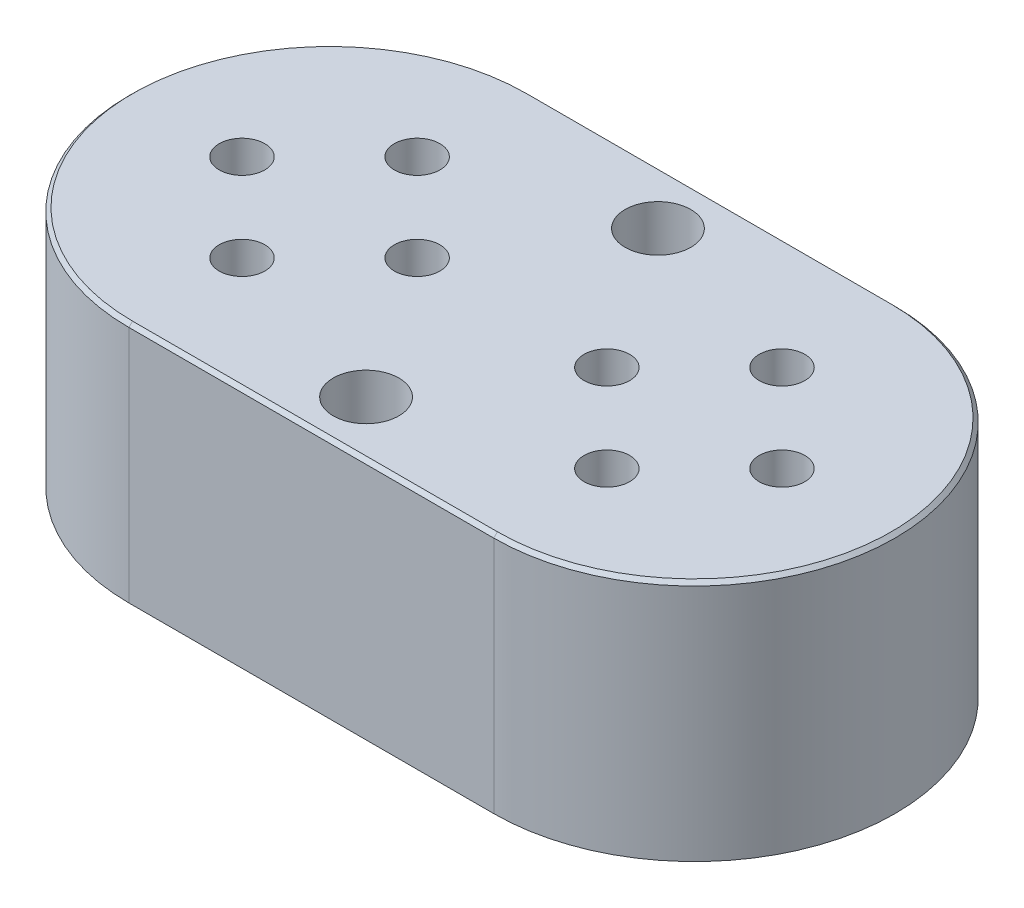
ISO-10303-21;
HEADER;
FILE_DESCRIPTION(('STEP AP214'),'2;1');
FILE_NAME('part.step','',(''),(''),'','','');
FILE_SCHEMA(('AUTOMOTIVE_DESIGN { 1 0 10303 214 1 1 1 1 }'));
ENDSEC;
DATA;
#1=APPLICATION_CONTEXT('core data for automotive mechanical design processes');
#2=APPLICATION_PROTOCOL_DEFINITION('international standard','automotive_design',2000,#1);
#3=PRODUCT_CONTEXT('',#1,'mechanical');
#4=PRODUCT('Part','Part','',(#3));
#5=PRODUCT_RELATED_PRODUCT_CATEGORY('part','',(#4));
#6=PRODUCT_DEFINITION_FORMATION('','',#4);
#7=PRODUCT_DEFINITION_CONTEXT('part definition',#1,'design');
#8=PRODUCT_DEFINITION('design','',#6,#7);
#9=PRODUCT_DEFINITION_SHAPE('','',#8);
#10=(LENGTH_UNIT() NAMED_UNIT(*) SI_UNIT(.MILLI.,.METRE.));
#11=(NAMED_UNIT(*) PLANE_ANGLE_UNIT() SI_UNIT($,.RADIAN.));
#12=(NAMED_UNIT(*) SI_UNIT($,.STERADIAN.) SOLID_ANGLE_UNIT());
#13=UNCERTAINTY_MEASURE_WITH_UNIT(LENGTH_MEASURE(1.E-05),#10,'distance_accuracy_value','');
#14=(GEOMETRIC_REPRESENTATION_CONTEXT(3) GLOBAL_UNCERTAINTY_ASSIGNED_CONTEXT((#13)) GLOBAL_UNIT_ASSIGNED_CONTEXT((#10,
#11,#12)) REPRESENTATION_CONTEXT('',''));
#15=CARTESIAN_POINT('',(0.,0.,0.));
#16=DIRECTION('',(0.,0.,1.));
#17=DIRECTION('',(1.,0.,0.));
#18=AXIS2_PLACEMENT_3D('',#15,#16,#17);
#19=CARTESIAN_POINT('',(0.,16.8656,0.));
#20=DIRECTION('',(0.,-1.,0.));
#21=DIRECTION('',(0.,0.,-1.));
#22=AXIS2_PLACEMENT_3D('',#19,#20,#21);
#23=CYLINDRICAL_SURFACE('',#22,13.97);
#24=DIRECTION('',(0.,-1.,0.));
#25=VECTOR('',#24,1.);
#26=CARTESIAN_POINT('',(0.,16.8656,13.97));
#27=LINE('',#26,#25);
#28=CARTESIAN_POINT('',(0.,16.6116,13.97));
#29=VERTEX_POINT('',#28);
#30=CARTESIAN_POINT('',(0.,0.,13.97));
#31=VERTEX_POINT('',#30);
#32=EDGE_CURVE('E86',#29,#31,#27,.T.);
#33=ORIENTED_EDGE('',*,*,#32,.F.);
#34=CARTESIAN_POINT('',(0.,16.6116,0.));
#35=DIRECTION('',(0.,1.,0.));
#36=DIRECTION('',(0.,0.,1.));
#37=AXIS2_PLACEMENT_3D('',#34,#35,#36);
#38=CIRCLE('',#37,13.97);
#39=CARTESIAN_POINT('',(0.,16.6116,-13.97));
#40=VERTEX_POINT('',#39);
#41=EDGE_CURVE('E11',#29,#40,#38,.F.);
#42=ORIENTED_EDGE('',*,*,#41,.T.);
#43=DIRECTION('',(0.,-1.,0.));
#44=VECTOR('',#43,1.);
#45=CARTESIAN_POINT('',(0.,16.8656,-13.97));
#46=LINE('',#45,#44);
#47=CARTESIAN_POINT('',(0.,0.,-13.97));
#48=VERTEX_POINT('',#47);
#49=EDGE_CURVE('E103',#40,#48,#46,.T.);
#50=ORIENTED_EDGE('',*,*,#49,.T.);
#51=CARTESIAN_POINT('',(0.,0.,0.));
#52=DIRECTION('',(0.,1.,0.));
#53=DIRECTION('',(0.,0.,1.));
#54=AXIS2_PLACEMENT_3D('',#51,#52,#53);
#55=CIRCLE('',#54,13.97);
#56=EDGE_CURVE('E99',#48,#31,#55,.T.);
#57=ORIENTED_EDGE('',*,*,#56,.T.);
#58=EDGE_LOOP('',(#33,#42,#50,#57));
#59=FACE_BOUND('',#58,.T.);
#60=ADVANCED_FACE('F34',(#59),#23,.T.);
#61=CARTESIAN_POINT('',(0.,16.8656,13.97));
#62=DIRECTION('',(0.,0.,-1.));
#63=DIRECTION('',(-1.,0.,0.));
#64=AXIS2_PLACEMENT_3D('',#61,#62,#63);
#65=PLANE('',#64);
#66=DIRECTION('',(0.,-1.,0.));
#67=VECTOR('',#66,1.);
#68=CARTESIAN_POINT('',(25.4,16.8656,13.97));
#69=LINE('',#68,#67);
#70=CARTESIAN_POINT('',(25.4,16.6116,13.97));
#71=VERTEX_POINT('',#70);
#72=CARTESIAN_POINT('',(25.4,0.,13.97));
#73=VERTEX_POINT('',#72);
#74=EDGE_CURVE('E93',#71,#73,#69,.T.);
#75=ORIENTED_EDGE('',*,*,#74,.F.);
#76=DIRECTION('',(-1.,0.,0.));
#77=VECTOR('',#76,1.);
#78=CARTESIAN_POINT('',(0.,16.6116,13.97));
#79=LINE('',#78,#77);
#80=EDGE_CURVE('E44',#71,#29,#79,.T.);
#81=ORIENTED_EDGE('',*,*,#80,.T.);
#82=ORIENTED_EDGE('',*,*,#32,.T.);
#83=DIRECTION('',(1.,0.,0.));
#84=VECTOR('',#83,1.);
#85=CARTESIAN_POINT('',(0.,0.,13.97));
#86=LINE('',#85,#84);
#87=EDGE_CURVE('E89',#31,#73,#86,.T.);
#88=ORIENTED_EDGE('',*,*,#87,.T.);
#89=EDGE_LOOP('',(#75,#81,#82,#88));
#90=FACE_BOUND('',#89,.T.);
#91=ADVANCED_FACE('F88',(#90),#65,.F.);
#92=CARTESIAN_POINT('',(25.4,16.8656,0.));
#93=DIRECTION('',(0.,-1.,0.));
#94=DIRECTION('',(0.,0.,-1.));
#95=AXIS2_PLACEMENT_3D('',#92,#93,#94);
#96=CYLINDRICAL_SURFACE('',#95,13.97);
#97=DIRECTION('',(0.,-1.,0.));
#98=VECTOR('',#97,1.);
#99=CARTESIAN_POINT('',(25.4,16.8656,-13.97));
#100=LINE('',#99,#98);
#101=CARTESIAN_POINT('',(25.4,16.6116,-13.97));
#102=VERTEX_POINT('',#101);
#103=CARTESIAN_POINT('',(25.4,0.,-13.97));
#104=VERTEX_POINT('',#103);
#105=EDGE_CURVE('E116',#102,#104,#100,.T.);
#106=ORIENTED_EDGE('',*,*,#105,.F.);
#107=CARTESIAN_POINT('',(25.4,16.6116,0.));
#108=DIRECTION('',(0.,1.,0.));
#109=DIRECTION('',(0.,0.,1.));
#110=AXIS2_PLACEMENT_3D('',#107,#108,#109);
#111=CIRCLE('',#110,13.97);
#112=EDGE_CURVE('E127',#102,#71,#111,.F.);
#113=ORIENTED_EDGE('',*,*,#112,.T.);
#114=ORIENTED_EDGE('',*,*,#74,.T.);
#115=CARTESIAN_POINT('',(25.4,0.,0.));
#116=DIRECTION('',(0.,1.,0.));
#117=DIRECTION('',(0.,0.,1.));
#118=AXIS2_PLACEMENT_3D('',#115,#116,#117);
#119=CIRCLE('',#118,13.97);
#120=EDGE_CURVE('E101',#73,#104,#119,.T.);
#121=ORIENTED_EDGE('',*,*,#120,.T.);
#122=EDGE_LOOP('',(#106,#113,#114,#121));
#123=FACE_BOUND('',#122,.T.);
#124=ADVANCED_FACE('F157',(#123),#96,.T.);
#125=CARTESIAN_POINT('',(0.,16.8656,-13.97));
#126=DIRECTION('',(0.,0.,1.));
#127=DIRECTION('',(1.,0.,0.));
#128=AXIS2_PLACEMENT_3D('',#125,#126,#127);
#129=PLANE('',#128);
#130=ORIENTED_EDGE('',*,*,#49,.F.);
#131=DIRECTION('',(1.,0.,0.));
#132=VECTOR('',#131,1.);
#133=CARTESIAN_POINT('',(25.4,16.6116,-13.97));
#134=LINE('',#133,#132);
#135=EDGE_CURVE('E130',#40,#102,#134,.T.);
#136=ORIENTED_EDGE('',*,*,#135,.T.);
#137=ORIENTED_EDGE('',*,*,#105,.T.);
#138=DIRECTION('',(-1.,0.,0.));
#139=VECTOR('',#138,1.);
#140=CARTESIAN_POINT('',(0.,0.,-13.97));
#141=LINE('',#140,#139);
#142=EDGE_CURVE('E113',#104,#48,#141,.T.);
#143=ORIENTED_EDGE('',*,*,#142,.T.);
#144=EDGE_LOOP('',(#130,#136,#137,#143));
#145=FACE_BOUND('',#144,.T.);
#146=ADVANCED_FACE('F159',(#145),#129,.F.);
#147=CARTESIAN_POINT('',(0.,16.8656,0.));
#148=DIRECTION('',(0.,1.,0.));
#149=DIRECTION('',(0.,0.,1.));
#150=AXIS2_PLACEMENT_3D('',#147,#148,#149);
#151=PLANE('',#150);
#152=CARTESIAN_POINT('',(12.7,16.8656,-10.16));
#153=DIRECTION('',(0.,1.,0.));
#154=DIRECTION('',(0.,0.,1.));
#155=AXIS2_PLACEMENT_3D('',#152,#153,#154);
#156=CIRCLE('',#155,2.286);
#157=CARTESIAN_POINT('',(12.7,16.8656,-7.874));
#158=VERTEX_POINT('',#157);
#159=EDGE_CURVE('E282',#158,#158,#156,.T.);
#160=ORIENTED_EDGE('',*,*,#159,.F.);
#161=EDGE_LOOP('',(#160));
#162=FACE_BOUND('',#161,.T.);
#163=CARTESIAN_POINT('',(12.7,16.8656,10.16));
#164=DIRECTION('',(0.,1.,0.));
#165=DIRECTION('',(0.,0.,-1.));
#166=AXIS2_PLACEMENT_3D('',#163,#164,#165);
#167=CIRCLE('',#166,2.286);
#168=CARTESIAN_POINT('',(12.7,16.8656,7.874));
#169=VERTEX_POINT('',#168);
#170=EDGE_CURVE('E288',#169,#169,#167,.T.);
#171=ORIENTED_EDGE('',*,*,#170,.F.);
#172=EDGE_LOOP('',(#171));
#173=FACE_BOUND('',#172,.T.);
#174=CARTESIAN_POINT('',(31.496,16.8656,0.));
#175=DIRECTION('',(0.,1.,0.));
#176=DIRECTION('',(0.,0.,1.));
#177=AXIS2_PLACEMENT_3D('',#174,#175,#176);
#178=CIRCLE('',#177,1.5875);
#179=CARTESIAN_POINT('',(31.496,16.8656,1.5875));
#180=VERTEX_POINT('',#179);
#181=EDGE_CURVE('E314',#180,#180,#178,.T.);
#182=ORIENTED_EDGE('',*,*,#181,.F.);
#183=EDGE_LOOP('',(#182));
#184=FACE_BOUND('',#183,.T.);
#185=CARTESIAN_POINT('',(25.4,16.8656,6.096));
#186=DIRECTION('',(0.,1.,0.));
#187=DIRECTION('',(0.,0.,1.));
#188=AXIS2_PLACEMENT_3D('',#185,#186,#187);
#189=CIRCLE('',#188,1.5875);
#190=CARTESIAN_POINT('',(25.4,16.8656,7.6835));
#191=VERTEX_POINT('',#190);
#192=EDGE_CURVE('E320',#191,#191,#189,.T.);
#193=ORIENTED_EDGE('',*,*,#192,.F.);
#194=EDGE_LOOP('',(#193));
#195=FACE_BOUND('',#194,.T.);
#196=CARTESIAN_POINT('',(19.304,16.8656,0.));
#197=DIRECTION('',(0.,1.,0.));
#198=DIRECTION('',(0.,0.,1.));
#199=AXIS2_PLACEMENT_3D('',#196,#197,#198);
#200=CIRCLE('',#199,1.5875);
#201=CARTESIAN_POINT('',(19.304,16.8656,1.5875));
#202=VERTEX_POINT('',#201);
#203=EDGE_CURVE('E326',#202,#202,#200,.T.);
#204=ORIENTED_EDGE('',*,*,#203,.F.);
#205=EDGE_LOOP('',(#204));
#206=FACE_BOUND('',#205,.T.);
#207=CARTESIAN_POINT('',(-6.096,16.8656,0.));
#208=DIRECTION('',(0.,1.,0.));
#209=DIRECTION('',(0.,0.,-1.));
#210=AXIS2_PLACEMENT_3D('',#207,#208,#209);
#211=CIRCLE('',#210,1.5875);
#212=CARTESIAN_POINT('',(-6.096,16.8656,-1.5875));
#213=VERTEX_POINT('',#212);
#214=EDGE_CURVE('E296',#213,#213,#211,.T.);
#215=ORIENTED_EDGE('',*,*,#214,.F.);
#216=EDGE_LOOP('',(#215));
#217=FACE_BOUND('',#216,.T.);
#218=CARTESIAN_POINT('',(6.096,16.8656,0.));
#219=DIRECTION('',(0.,1.,0.));
#220=DIRECTION('',(0.,0.,-1.));
#221=AXIS2_PLACEMENT_3D('',#218,#219,#220);
#222=CIRCLE('',#221,1.5875);
#223=CARTESIAN_POINT('',(6.096,16.8656,-1.5875));
#224=VERTEX_POINT('',#223);
#225=EDGE_CURVE('E297',#224,#224,#222,.T.);
#226=ORIENTED_EDGE('',*,*,#225,.F.);
#227=EDGE_LOOP('',(#226));
#228=FACE_BOUND('',#227,.T.);
#229=CARTESIAN_POINT('',(0.,16.8656,6.096));
#230=DIRECTION('',(0.,1.,0.));
#231=DIRECTION('',(0.,0.,-1.));
#232=AXIS2_PLACEMENT_3D('',#229,#230,#231);
#233=CIRCLE('',#232,1.5875);
#234=CARTESIAN_POINT('',(0.,16.8656,4.5085));
#235=VERTEX_POINT('',#234);
#236=EDGE_CURVE('E303',#235,#235,#233,.T.);
#237=ORIENTED_EDGE('',*,*,#236,.F.);
#238=EDGE_LOOP('',(#237));
#239=FACE_BOUND('',#238,.T.);
#240=CARTESIAN_POINT('',(0.,16.8656,-6.096));
#241=DIRECTION('',(0.,1.,0.));
#242=DIRECTION('',(0.,0.,-1.));
#243=AXIS2_PLACEMENT_3D('',#240,#241,#242);
#244=CIRCLE('',#243,1.5875);
#245=CARTESIAN_POINT('',(0.,16.8656,-7.6835));
#246=VERTEX_POINT('',#245);
#247=EDGE_CURVE('E285',#246,#246,#244,.T.);
#248=ORIENTED_EDGE('',*,*,#247,.F.);
#249=EDGE_LOOP('',(#248));
#250=FACE_BOUND('',#249,.T.);
#251=CARTESIAN_POINT('',(25.4,16.8656,-6.096));
#252=DIRECTION('',(0.,1.,0.));
#253=DIRECTION('',(0.,0.,1.));
#254=AXIS2_PLACEMENT_3D('',#251,#252,#253);
#255=CIRCLE('',#254,1.5875);
#256=CARTESIAN_POINT('',(25.4,16.8656,-4.5085));
#257=VERTEX_POINT('',#256);
#258=EDGE_CURVE('E109',#257,#257,#255,.T.);
#259=ORIENTED_EDGE('',*,*,#258,.F.);
#260=EDGE_LOOP('',(#259));
#261=FACE_BOUND('',#260,.T.);
#262=DIRECTION('',(1.,0.,0.));
#263=VECTOR('',#262,1.);
#264=CARTESIAN_POINT('',(25.4,16.8656,13.716));
#265=LINE('',#264,#263);
#266=CARTESIAN_POINT('',(0.,16.8656,13.716));
#267=VERTEX_POINT('',#266);
#268=CARTESIAN_POINT('',(25.4,16.8656,13.716));
#269=VERTEX_POINT('',#268);
#270=EDGE_CURVE('E120',#267,#269,#265,.T.);
#271=ORIENTED_EDGE('',*,*,#270,.T.);
#272=CARTESIAN_POINT('',(25.4,16.8656,0.));
#273=DIRECTION('',(0.,1.,0.));
#274=DIRECTION('',(0.,0.,1.));
#275=AXIS2_PLACEMENT_3D('',#272,#273,#274);
#276=CIRCLE('',#275,13.716);
#277=CARTESIAN_POINT('',(25.4,16.8656,-13.716));
#278=VERTEX_POINT('',#277);
#279=EDGE_CURVE('E124',#269,#278,#276,.T.);
#280=ORIENTED_EDGE('',*,*,#279,.T.);
#281=DIRECTION('',(-1.,0.,0.));
#282=VECTOR('',#281,1.);
#283=CARTESIAN_POINT('',(0.,16.8656,-13.716));
#284=LINE('',#283,#282);
#285=CARTESIAN_POINT('',(0.,16.8656,-13.716));
#286=VERTEX_POINT('',#285);
#287=EDGE_CURVE('E122',#278,#286,#284,.T.);
#288=ORIENTED_EDGE('',*,*,#287,.T.);
#289=CARTESIAN_POINT('',(0.,16.8656,0.));
#290=DIRECTION('',(0.,1.,0.));
#291=DIRECTION('',(0.,0.,1.));
#292=AXIS2_PLACEMENT_3D('',#289,#290,#291);
#293=CIRCLE('',#292,13.716);
#294=EDGE_CURVE('E92',#286,#267,#293,.T.);
#295=ORIENTED_EDGE('',*,*,#294,.T.);
#296=EDGE_LOOP('',(#271,#280,#288,#295));
#297=FACE_BOUND('',#296,.T.);
#298=ADVANCED_FACE('F149',(#162,#173,#184,#195,#206,#217,#228,#239,#250,#261,#297),#151,.T.);
#299=CARTESIAN_POINT('',(0.,0.,0.));
#300=DIRECTION('',(0.,1.,0.));
#301=DIRECTION('',(0.,0.,1.));
#302=AXIS2_PLACEMENT_3D('',#299,#300,#301);
#303=PLANE('',#302);
#304=CARTESIAN_POINT('',(12.7,0.,-10.16));
#305=DIRECTION('',(0.,1.,0.));
#306=DIRECTION('',(0.,0.,1.));
#307=AXIS2_PLACEMENT_3D('',#304,#305,#306);
#308=CIRCLE('',#307,2.286);
#309=CARTESIAN_POINT('',(12.7,0.,-7.874));
#310=VERTEX_POINT('',#309);
#311=EDGE_CURVE('E279',#310,#310,#308,.T.);
#312=ORIENTED_EDGE('',*,*,#311,.T.);
#313=EDGE_LOOP('',(#312));
#314=FACE_BOUND('',#313,.T.);
#315=CARTESIAN_POINT('',(12.7,0.,10.16));
#316=DIRECTION('',(0.,1.,0.));
#317=DIRECTION('',(0.,0.,-1.));
#318=AXIS2_PLACEMENT_3D('',#315,#316,#317);
#319=CIRCLE('',#318,2.286);
#320=CARTESIAN_POINT('',(12.7,0.,7.874));
#321=VERTEX_POINT('',#320);
#322=EDGE_CURVE('E283',#321,#321,#319,.T.);
#323=ORIENTED_EDGE('',*,*,#322,.T.);
#324=EDGE_LOOP('',(#323));
#325=FACE_BOUND('',#324,.T.);
#326=ORIENTED_EDGE('',*,*,#56,.F.);
#327=ORIENTED_EDGE('',*,*,#142,.F.);
#328=ORIENTED_EDGE('',*,*,#120,.F.);
#329=ORIENTED_EDGE('',*,*,#87,.F.);
#330=EDGE_LOOP('',(#326,#327,#328,#329));
#331=FACE_BOUND('',#330,.T.);
#332=ADVANCED_FACE('F97',(#314,#325,#331),#303,.F.);
#333=CARTESIAN_POINT('',(0.,16.8656,0.));
#334=DIRECTION('',(0.,-1.,0.));
#335=DIRECTION('',(0.,0.,-1.));
#336=AXIS2_PLACEMENT_3D('',#333,#334,#335);
#337=CONICAL_SURFACE('',#336,13.716,0.785398163397442);
#338=DIRECTION('',(0.,0.707106781186552,0.707106781186543));
#339=VECTOR('',#338,1.);
#340=CARTESIAN_POINT('',(0.,16.6116,-13.97));
#341=LINE('',#340,#339);
#342=EDGE_CURVE('E107',#40,#286,#341,.T.);
#343=ORIENTED_EDGE('',*,*,#342,.F.);
#344=ORIENTED_EDGE('',*,*,#41,.F.);
#345=DIRECTION('',(0.,-0.707106781186552,0.707106781186543));
#346=VECTOR('',#345,1.);
#347=CARTESIAN_POINT('',(0.,16.8656,13.716));
#348=LINE('',#347,#346);
#349=EDGE_CURVE('E39',#267,#29,#348,.T.);
#350=ORIENTED_EDGE('',*,*,#349,.F.);
#351=ORIENTED_EDGE('',*,*,#294,.F.);
#352=EDGE_LOOP('',(#343,#344,#350,#351));
#353=FACE_BOUND('',#352,.T.);
#354=ADVANCED_FACE('F37',(#353),#337,.T.);
#355=CARTESIAN_POINT('',(0.,16.8656,13.716));
#356=DIRECTION('',(0.,0.707106781186543,0.707106781186552));
#357=DIRECTION('',(-1.,0.,0.));
#358=AXIS2_PLACEMENT_3D('',#355,#356,#357);
#359=PLANE('',#358);
#360=ORIENTED_EDGE('',*,*,#349,.T.);
#361=ORIENTED_EDGE('',*,*,#80,.F.);
#362=DIRECTION('',(0.,-0.707106781186552,0.707106781186543));
#363=VECTOR('',#362,1.);
#364=CARTESIAN_POINT('',(25.4,16.8656,13.716));
#365=LINE('',#364,#363);
#366=EDGE_CURVE('E135',#269,#71,#365,.T.);
#367=ORIENTED_EDGE('',*,*,#366,.F.);
#368=ORIENTED_EDGE('',*,*,#270,.F.);
#369=EDGE_LOOP('',(#360,#361,#367,#368));
#370=FACE_BOUND('',#369,.T.);
#371=ADVANCED_FACE('F188',(#370),#359,.T.);
#372=CARTESIAN_POINT('',(0.,16.8656,-13.716));
#373=DIRECTION('',(0.,0.707106781186543,-0.707106781186552));
#374=DIRECTION('',(1.,0.,0.));
#375=AXIS2_PLACEMENT_3D('',#372,#373,#374);
#376=PLANE('',#375);
#377=ORIENTED_EDGE('',*,*,#342,.T.);
#378=ORIENTED_EDGE('',*,*,#287,.F.);
#379=DIRECTION('',(0.,0.707106781186552,0.707106781186543));
#380=VECTOR('',#379,1.);
#381=CARTESIAN_POINT('',(25.4,16.6116,-13.97));
#382=LINE('',#381,#380);
#383=EDGE_CURVE('E133',#102,#278,#382,.T.);
#384=ORIENTED_EDGE('',*,*,#383,.F.);
#385=ORIENTED_EDGE('',*,*,#135,.F.);
#386=EDGE_LOOP('',(#377,#378,#384,#385));
#387=FACE_BOUND('',#386,.T.);
#388=ADVANCED_FACE('F142',(#387),#376,.T.);
#389=CARTESIAN_POINT('',(25.4,16.8656,0.));
#390=DIRECTION('',(0.,-1.,0.));
#391=DIRECTION('',(0.,0.,-1.));
#392=AXIS2_PLACEMENT_3D('',#389,#390,#391);
#393=CONICAL_SURFACE('',#392,13.716,0.785398163397442);
#394=ORIENTED_EDGE('',*,*,#366,.T.);
#395=ORIENTED_EDGE('',*,*,#112,.F.);
#396=ORIENTED_EDGE('',*,*,#383,.T.);
#397=ORIENTED_EDGE('',*,*,#279,.F.);
#398=EDGE_LOOP('',(#394,#395,#396,#397));
#399=FACE_BOUND('',#398,.T.);
#400=ADVANCED_FACE('F153',(#399),#393,.T.);
#401=CARTESIAN_POINT('',(25.4,0.508000000000002,-6.096));
#402=DIRECTION('',(0.,1.,0.));
#403=DIRECTION('',(0.,0.,1.));
#404=AXIS2_PLACEMENT_3D('',#401,#402,#403);
#405=CYLINDRICAL_SURFACE('',#404,1.5875);
#406=CARTESIAN_POINT('',(25.4,0.508000000000002,-6.096));
#407=DIRECTION('',(0.,1.,0.));
#408=DIRECTION('',(0.,0.,1.));
#409=AXIS2_PLACEMENT_3D('',#406,#407,#408);
#410=CIRCLE('',#409,1.5875);
#411=CARTESIAN_POINT('',(25.4,0.508000000000002,-4.5085));
#412=VERTEX_POINT('',#411);
#413=EDGE_CURVE('E136',#412,#412,#410,.T.);
#414=ORIENTED_EDGE('',*,*,#413,.F.);
#415=EDGE_LOOP('',(#414));
#416=FACE_BOUND('',#415,.T.);
#417=ORIENTED_EDGE('',*,*,#258,.T.);
#418=EDGE_LOOP('',(#417));
#419=FACE_BOUND('',#418,.T.);
#420=ADVANCED_FACE('F183',(#416,#419),#405,.F.);
#421=CARTESIAN_POINT('',(25.4,0.508000000000002,-6.096));
#422=DIRECTION('',(0.,1.,0.));
#423=DIRECTION('',(0.,0.,1.));
#424=AXIS2_PLACEMENT_3D('',#421,#422,#423);
#425=PLANE('',#424);
#426=ORIENTED_EDGE('',*,*,#413,.T.);
#427=EDGE_LOOP('',(#426));
#428=FACE_BOUND('',#427,.T.);
#429=ADVANCED_FACE('F207',(#428),#425,.T.);
#430=CARTESIAN_POINT('',(0.,0.508000000000002,-6.096));
#431=DIRECTION('',(0.,1.,0.));
#432=DIRECTION('',(0.,0.,1.));
#433=AXIS2_PLACEMENT_3D('',#430,#431,#432);
#434=CYLINDRICAL_SURFACE('',#433,1.5875);
#435=CARTESIAN_POINT('',(0.,0.508000000000002,-6.096));
#436=DIRECTION('',(0.,1.,0.));
#437=DIRECTION('',(0.,0.,-1.));
#438=AXIS2_PLACEMENT_3D('',#435,#436,#437);
#439=CIRCLE('',#438,1.5875);
#440=CARTESIAN_POINT('',(0.,0.508000000000002,-7.6835));
#441=VERTEX_POINT('',#440);
#442=EDGE_CURVE('E306',#441,#441,#439,.T.);
#443=ORIENTED_EDGE('',*,*,#442,.F.);
#444=EDGE_LOOP('',(#443));
#445=FACE_BOUND('',#444,.T.);
#446=ORIENTED_EDGE('',*,*,#247,.T.);
#447=EDGE_LOOP('',(#446));
#448=FACE_BOUND('',#447,.T.);
#449=ADVANCED_FACE('F211',(#445,#448),#434,.F.);
#450=CARTESIAN_POINT('',(0.,0.508000000000002,-6.096));
#451=DIRECTION('',(0.,-1.,0.));
#452=DIRECTION('',(0.,0.,-1.));
#453=AXIS2_PLACEMENT_3D('',#450,#451,#452);
#454=PLANE('',#453);
#455=ORIENTED_EDGE('',*,*,#442,.T.);
#456=EDGE_LOOP('',(#455));
#457=FACE_BOUND('',#456,.T.);
#458=ADVANCED_FACE('F249',(#457),#454,.F.);
#459=CARTESIAN_POINT('',(0.,0.508000000000002,6.096));
#460=DIRECTION('',(0.,1.,0.));
#461=DIRECTION('',(0.,0.,1.));
#462=AXIS2_PLACEMENT_3D('',#459,#460,#461);
#463=CYLINDRICAL_SURFACE('',#462,1.5875);
#464=CARTESIAN_POINT('',(0.,0.508000000000002,6.096));
#465=DIRECTION('',(0.,1.,0.));
#466=DIRECTION('',(0.,0.,-1.));
#467=AXIS2_PLACEMENT_3D('',#464,#465,#466);
#468=CIRCLE('',#467,1.5875);
#469=CARTESIAN_POINT('',(0.,0.508000000000002,4.5085));
#470=VERTEX_POINT('',#469);
#471=EDGE_CURVE('E300',#470,#470,#468,.T.);
#472=ORIENTED_EDGE('',*,*,#471,.F.);
#473=EDGE_LOOP('',(#472));
#474=FACE_BOUND('',#473,.T.);
#475=ORIENTED_EDGE('',*,*,#236,.T.);
#476=EDGE_LOOP('',(#475));
#477=FACE_BOUND('',#476,.T.);
#478=ADVANCED_FACE('F253',(#474,#477),#463,.F.);
#479=CARTESIAN_POINT('',(0.,0.508000000000002,6.096));
#480=DIRECTION('',(0.,-1.,0.));
#481=DIRECTION('',(0.,0.,-1.));
#482=AXIS2_PLACEMENT_3D('',#479,#480,#481);
#483=PLANE('',#482);
#484=ORIENTED_EDGE('',*,*,#471,.T.);
#485=EDGE_LOOP('',(#484));
#486=FACE_BOUND('',#485,.T.);
#487=ADVANCED_FACE('F257',(#486),#483,.F.);
#488=CARTESIAN_POINT('',(6.096,0.508000000000002,0.));
#489=DIRECTION('',(0.,1.,0.));
#490=DIRECTION('',(0.,0.,1.));
#491=AXIS2_PLACEMENT_3D('',#488,#489,#490);
#492=CYLINDRICAL_SURFACE('',#491,1.5875);
#493=CARTESIAN_POINT('',(6.096,0.508000000000002,0.));
#494=DIRECTION('',(0.,1.,0.));
#495=DIRECTION('',(0.,0.,-1.));
#496=AXIS2_PLACEMENT_3D('',#493,#494,#495);
#497=CIRCLE('',#496,1.5875);
#498=CARTESIAN_POINT('',(6.096,0.508000000000002,-1.5875));
#499=VERTEX_POINT('',#498);
#500=EDGE_CURVE('E293',#499,#499,#497,.T.);
#501=ORIENTED_EDGE('',*,*,#500,.F.);
#502=EDGE_LOOP('',(#501));
#503=FACE_BOUND('',#502,.T.);
#504=ORIENTED_EDGE('',*,*,#225,.T.);
#505=EDGE_LOOP('',(#504));
#506=FACE_BOUND('',#505,.T.);
#507=ADVANCED_FACE('F261',(#503,#506),#492,.F.);
#508=CARTESIAN_POINT('',(6.096,0.508000000000002,0.));
#509=DIRECTION('',(0.,-1.,0.));
#510=DIRECTION('',(0.,0.,-1.));
#511=AXIS2_PLACEMENT_3D('',#508,#509,#510);
#512=PLANE('',#511);
#513=ORIENTED_EDGE('',*,*,#500,.T.);
#514=EDGE_LOOP('',(#513));
#515=FACE_BOUND('',#514,.T.);
#516=ADVANCED_FACE('F217',(#515),#512,.F.);
#517=CARTESIAN_POINT('',(-6.096,0.508000000000002,0.));
#518=DIRECTION('',(0.,1.,0.));
#519=DIRECTION('',(0.,0.,1.));
#520=AXIS2_PLACEMENT_3D('',#517,#518,#519);
#521=CYLINDRICAL_SURFACE('',#520,1.5875);
#522=CARTESIAN_POINT('',(-6.096,0.508000000000002,0.));
#523=DIRECTION('',(0.,1.,0.));
#524=DIRECTION('',(0.,0.,-1.));
#525=AXIS2_PLACEMENT_3D('',#522,#523,#524);
#526=CIRCLE('',#525,1.5875);
#527=CARTESIAN_POINT('',(-6.096,0.508000000000002,-1.5875));
#528=VERTEX_POINT('',#527);
#529=EDGE_CURVE('E329',#528,#528,#526,.T.);
#530=ORIENTED_EDGE('',*,*,#529,.F.);
#531=EDGE_LOOP('',(#530));
#532=FACE_BOUND('',#531,.T.);
#533=ORIENTED_EDGE('',*,*,#214,.T.);
#534=EDGE_LOOP('',(#533));
#535=FACE_BOUND('',#534,.T.);
#536=ADVANCED_FACE('F213',(#532,#535),#521,.F.);
#537=CARTESIAN_POINT('',(-6.096,0.508000000000002,0.));
#538=DIRECTION('',(0.,-1.,0.));
#539=DIRECTION('',(0.,0.,-1.));
#540=AXIS2_PLACEMENT_3D('',#537,#538,#539);
#541=PLANE('',#540);
#542=ORIENTED_EDGE('',*,*,#529,.T.);
#543=EDGE_LOOP('',(#542));
#544=FACE_BOUND('',#543,.T.);
#545=ADVANCED_FACE('F216',(#544),#541,.F.);
#546=CARTESIAN_POINT('',(19.304,0.508000000000002,0.));
#547=DIRECTION('',(0.,1.,0.));
#548=DIRECTION('',(0.,0.,1.));
#549=AXIS2_PLACEMENT_3D('',#546,#547,#548);
#550=CYLINDRICAL_SURFACE('',#549,1.5875);
#551=CARTESIAN_POINT('',(19.304,0.508000000000002,0.));
#552=DIRECTION('',(0.,1.,0.));
#553=DIRECTION('',(0.,0.,1.));
#554=AXIS2_PLACEMENT_3D('',#551,#552,#553);
#555=CIRCLE('',#554,1.5875);
#556=CARTESIAN_POINT('',(19.304,0.508000000000002,1.5875));
#557=VERTEX_POINT('',#556);
#558=EDGE_CURVE('E323',#557,#557,#555,.T.);
#559=ORIENTED_EDGE('',*,*,#558,.F.);
#560=EDGE_LOOP('',(#559));
#561=FACE_BOUND('',#560,.T.);
#562=ORIENTED_EDGE('',*,*,#203,.T.);
#563=EDGE_LOOP('',(#562));
#564=FACE_BOUND('',#563,.T.);
#565=ADVANCED_FACE('F221',(#561,#564),#550,.F.);
#566=CARTESIAN_POINT('',(19.304,0.508000000000002,0.));
#567=DIRECTION('',(0.,1.,0.));
#568=DIRECTION('',(0.,0.,1.));
#569=AXIS2_PLACEMENT_3D('',#566,#567,#568);
#570=PLANE('',#569);
#571=ORIENTED_EDGE('',*,*,#558,.T.);
#572=EDGE_LOOP('',(#571));
#573=FACE_BOUND('',#572,.T.);
#574=ADVANCED_FACE('F225',(#573),#570,.T.);
#575=CARTESIAN_POINT('',(25.4,0.508000000000002,6.096));
#576=DIRECTION('',(0.,1.,0.));
#577=DIRECTION('',(0.,0.,1.));
#578=AXIS2_PLACEMENT_3D('',#575,#576,#577);
#579=CYLINDRICAL_SURFACE('',#578,1.5875);
#580=CARTESIAN_POINT('',(25.4,0.508000000000002,6.096));
#581=DIRECTION('',(0.,1.,0.));
#582=DIRECTION('',(0.,0.,1.));
#583=AXIS2_PLACEMENT_3D('',#580,#581,#582);
#584=CIRCLE('',#583,1.5875);
#585=CARTESIAN_POINT('',(25.4,0.508000000000002,7.6835));
#586=VERTEX_POINT('',#585);
#587=EDGE_CURVE('E317',#586,#586,#584,.T.);
#588=ORIENTED_EDGE('',*,*,#587,.F.);
#589=EDGE_LOOP('',(#588));
#590=FACE_BOUND('',#589,.T.);
#591=ORIENTED_EDGE('',*,*,#192,.T.);
#592=EDGE_LOOP('',(#591));
#593=FACE_BOUND('',#592,.T.);
#594=ADVANCED_FACE('F229',(#590,#593),#579,.F.);
#595=CARTESIAN_POINT('',(25.4,0.508000000000002,6.096));
#596=DIRECTION('',(0.,1.,0.));
#597=DIRECTION('',(0.,0.,1.));
#598=AXIS2_PLACEMENT_3D('',#595,#596,#597);
#599=PLANE('',#598);
#600=ORIENTED_EDGE('',*,*,#587,.T.);
#601=EDGE_LOOP('',(#600));
#602=FACE_BOUND('',#601,.T.);
#603=ADVANCED_FACE('F233',(#602),#599,.T.);
#604=CARTESIAN_POINT('',(31.496,0.508000000000002,0.));
#605=DIRECTION('',(0.,1.,0.));
#606=DIRECTION('',(0.,0.,1.));
#607=AXIS2_PLACEMENT_3D('',#604,#605,#606);
#608=CYLINDRICAL_SURFACE('',#607,1.5875);
#609=CARTESIAN_POINT('',(31.496,0.508000000000002,0.));
#610=DIRECTION('',(0.,1.,0.));
#611=DIRECTION('',(0.,0.,1.));
#612=AXIS2_PLACEMENT_3D('',#609,#610,#611);
#613=CIRCLE('',#612,1.5875);
#614=CARTESIAN_POINT('',(31.496,0.508000000000002,1.5875));
#615=VERTEX_POINT('',#614);
#616=EDGE_CURVE('E311',#615,#615,#613,.T.);
#617=ORIENTED_EDGE('',*,*,#616,.F.);
#618=EDGE_LOOP('',(#617));
#619=FACE_BOUND('',#618,.T.);
#620=ORIENTED_EDGE('',*,*,#181,.T.);
#621=EDGE_LOOP('',(#620));
#622=FACE_BOUND('',#621,.T.);
#623=ADVANCED_FACE('F237',(#619,#622),#608,.F.);
#624=CARTESIAN_POINT('',(31.496,0.508000000000002,0.));
#625=DIRECTION('',(0.,1.,0.));
#626=DIRECTION('',(0.,0.,1.));
#627=AXIS2_PLACEMENT_3D('',#624,#625,#626);
#628=PLANE('',#627);
#629=ORIENTED_EDGE('',*,*,#616,.T.);
#630=EDGE_LOOP('',(#629));
#631=FACE_BOUND('',#630,.T.);
#632=ADVANCED_FACE('F241',(#631),#628,.T.);
#633=CARTESIAN_POINT('',(12.7,0.,10.16));
#634=DIRECTION('',(0.,1.,0.));
#635=DIRECTION('',(0.,0.,1.));
#636=AXIS2_PLACEMENT_3D('',#633,#634,#635);
#637=CYLINDRICAL_SURFACE('',#636,2.286);
#638=ORIENTED_EDGE('',*,*,#322,.F.);
#639=EDGE_LOOP('',(#638));
#640=FACE_BOUND('',#639,.T.);
#641=ORIENTED_EDGE('',*,*,#170,.T.);
#642=EDGE_LOOP('',(#641));
#643=FACE_BOUND('',#642,.T.);
#644=ADVANCED_FACE('F245',(#640,#643),#637,.F.);
#645=CARTESIAN_POINT('',(12.7,0.,-10.16));
#646=DIRECTION('',(0.,1.,0.));
#647=DIRECTION('',(0.,0.,1.));
#648=AXIS2_PLACEMENT_3D('',#645,#646,#647);
#649=CYLINDRICAL_SURFACE('',#648,2.286);
#650=ORIENTED_EDGE('',*,*,#311,.F.);
#651=EDGE_LOOP('',(#650));
#652=FACE_BOUND('',#651,.T.);
#653=ORIENTED_EDGE('',*,*,#159,.T.);
#654=EDGE_LOOP('',(#653));
#655=FACE_BOUND('',#654,.T.);
#656=ADVANCED_FACE('F271',(#652,#655),#649,.F.);
#657=CLOSED_SHELL('',(#60,#91,#124,#146,#298,#332,#354,#371,#388,#400,#420,#429,#449,#458,#478,
#487,#507,#516,#536,#545,#565,#574,#594,#603,#623,#632,#644,#656));
#658=MANIFOLD_SOLID_BREP('B2',#657);
#659=ADVANCED_BREP_SHAPE_REPRESENTATION('',(#18,#658),#14);
#660=SHAPE_DEFINITION_REPRESENTATION(#9,#659);
ENDSEC;
END-ISO-10303-21;
